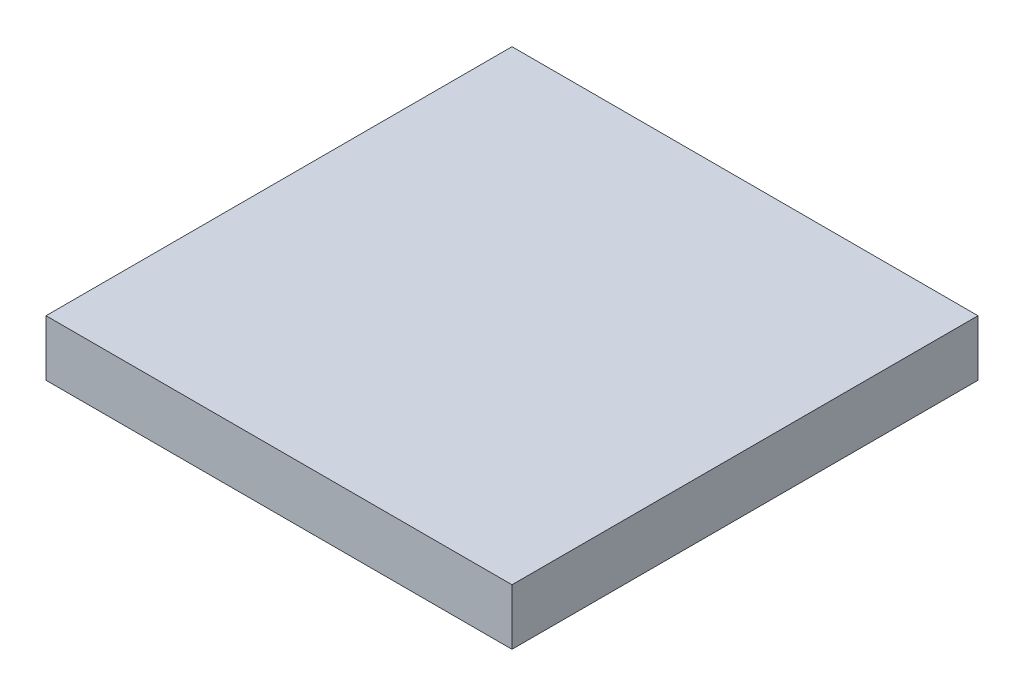
ISO-10303-21;
HEADER;
FILE_DESCRIPTION(('STEP AP214'),'2;1');
FILE_NAME('part.step','',(''),(''),'','','');
FILE_SCHEMA(('AUTOMOTIVE_DESIGN { 1 0 10303 214 1 1 1 1 }'));
ENDSEC;
DATA;
#1=APPLICATION_CONTEXT('core data for automotive mechanical design processes');
#2=APPLICATION_PROTOCOL_DEFINITION('international standard','automotive_design',2000,#1);
#3=PRODUCT_CONTEXT('',#1,'mechanical');
#4=PRODUCT('Part','Part','',(#3));
#5=PRODUCT_RELATED_PRODUCT_CATEGORY('part','',(#4));
#6=PRODUCT_DEFINITION_FORMATION('','',#4);
#7=PRODUCT_DEFINITION_CONTEXT('part definition',#1,'design');
#8=PRODUCT_DEFINITION('design','',#6,#7);
#9=PRODUCT_DEFINITION_SHAPE('','',#8);
#10=(LENGTH_UNIT() NAMED_UNIT(*) SI_UNIT(.MILLI.,.METRE.));
#11=(NAMED_UNIT(*) PLANE_ANGLE_UNIT() SI_UNIT($,.RADIAN.));
#12=(NAMED_UNIT(*) SI_UNIT($,.STERADIAN.) SOLID_ANGLE_UNIT());
#13=UNCERTAINTY_MEASURE_WITH_UNIT(LENGTH_MEASURE(1.E-05),#10,'distance_accuracy_value','');
#14=(GEOMETRIC_REPRESENTATION_CONTEXT(3) GLOBAL_UNCERTAINTY_ASSIGNED_CONTEXT((#13)) GLOBAL_UNIT_ASSIGNED_CONTEXT((#10,
#11,#12)) REPRESENTATION_CONTEXT('',''));
#15=CARTESIAN_POINT('',(0.,0.,0.));
#16=DIRECTION('',(0.,0.,1.));
#17=DIRECTION('',(1.,0.,0.));
#18=AXIS2_PLACEMENT_3D('',#15,#16,#17);
#19=CARTESIAN_POINT('',(12.5,3.,12.5));
#20=DIRECTION('',(-1.,0.,0.));
#21=DIRECTION('',(0.,0.,1.));
#22=AXIS2_PLACEMENT_3D('',#19,#20,#21);
#23=PLANE('',#22);
#24=DIRECTION('',(0.,0.,-1.));
#25=VECTOR('',#24,1.);
#26=CARTESIAN_POINT('',(12.5,0.,12.5));
#27=LINE('',#26,#25);
#28=CARTESIAN_POINT('',(12.5,0.,12.5));
#29=VERTEX_POINT('',#28);
#30=CARTESIAN_POINT('',(12.5,0.,-12.5));
#31=VERTEX_POINT('',#30);
#32=EDGE_CURVE('E96',#29,#31,#27,.T.);
#33=ORIENTED_EDGE('',*,*,#32,.T.);
#34=DIRECTION('',(0.,-1.,0.));
#35=VECTOR('',#34,1.);
#36=CARTESIAN_POINT('',(12.5,3.,-12.5));
#37=LINE('',#36,#35);
#38=CARTESIAN_POINT('',(12.5,3.,-12.5));
#39=VERTEX_POINT('',#38);
#40=EDGE_CURVE('E11',#39,#31,#37,.T.);
#41=ORIENTED_EDGE('',*,*,#40,.F.);
#42=DIRECTION('',(0.,0.,-1.));
#43=VECTOR('',#42,1.);
#44=CARTESIAN_POINT('',(12.5,3.,12.5));
#45=LINE('',#44,#43);
#46=CARTESIAN_POINT('',(12.5,3.,12.5));
#47=VERTEX_POINT('',#46);
#48=EDGE_CURVE('E84',#47,#39,#45,.T.);
#49=ORIENTED_EDGE('',*,*,#48,.F.);
#50=DIRECTION('',(0.,-1.,0.));
#51=VECTOR('',#50,1.);
#52=CARTESIAN_POINT('',(12.5,3.,12.5));
#53=LINE('',#52,#51);
#54=EDGE_CURVE('E92',#47,#29,#53,.T.);
#55=ORIENTED_EDGE('',*,*,#54,.T.);
#56=EDGE_LOOP('',(#33,#41,#49,#55));
#57=FACE_BOUND('',#56,.T.);
#58=ADVANCED_FACE('F33',(#57),#23,.F.);
#59=CARTESIAN_POINT('',(-12.5,3.,-12.5));
#60=DIRECTION('',(0.,0.,1.));
#61=DIRECTION('',(1.,0.,0.));
#62=AXIS2_PLACEMENT_3D('',#59,#60,#61);
#63=PLANE('',#62);
#64=DIRECTION('',(-1.,0.,0.));
#65=VECTOR('',#64,1.);
#66=CARTESIAN_POINT('',(-12.5,0.,-12.5));
#67=LINE('',#66,#65);
#68=CARTESIAN_POINT('',(-12.5,0.,-12.5));
#69=VERTEX_POINT('',#68);
#70=EDGE_CURVE('E88',#31,#69,#67,.T.);
#71=ORIENTED_EDGE('',*,*,#70,.T.);
#72=DIRECTION('',(0.,-1.,0.));
#73=VECTOR('',#72,1.);
#74=CARTESIAN_POINT('',(-12.5,3.,-12.5));
#75=LINE('',#74,#73);
#76=CARTESIAN_POINT('',(-12.5,3.,-12.5));
#77=VERTEX_POINT('',#76);
#78=EDGE_CURVE('E41',#77,#69,#75,.T.);
#79=ORIENTED_EDGE('',*,*,#78,.F.);
#80=DIRECTION('',(-1.,0.,0.));
#81=VECTOR('',#80,1.);
#82=CARTESIAN_POINT('',(-12.5,3.,-12.5));
#83=LINE('',#82,#81);
#84=EDGE_CURVE('E79',#39,#77,#83,.T.);
#85=ORIENTED_EDGE('',*,*,#84,.F.);
#86=ORIENTED_EDGE('',*,*,#40,.T.);
#87=EDGE_LOOP('',(#71,#79,#85,#86));
#88=FACE_BOUND('',#87,.T.);
#89=ADVANCED_FACE('F87',(#88),#63,.F.);
#90=CARTESIAN_POINT('',(-12.5,3.,12.5));
#91=DIRECTION('',(1.,0.,0.));
#92=DIRECTION('',(0.,0.,-1.));
#93=AXIS2_PLACEMENT_3D('',#90,#91,#92);
#94=PLANE('',#93);
#95=DIRECTION('',(0.,0.,1.));
#96=VECTOR('',#95,1.);
#97=CARTESIAN_POINT('',(-12.5,0.,12.5));
#98=LINE('',#97,#96);
#99=CARTESIAN_POINT('',(-12.5,0.,12.5));
#100=VERTEX_POINT('',#99);
#101=EDGE_CURVE('E66',#69,#100,#98,.T.);
#102=ORIENTED_EDGE('',*,*,#101,.T.);
#103=DIRECTION('',(0.,-1.,0.));
#104=VECTOR('',#103,1.);
#105=CARTESIAN_POINT('',(-12.5,3.,12.5));
#106=LINE('',#105,#104);
#107=CARTESIAN_POINT('',(-12.5,3.,12.5));
#108=VERTEX_POINT('',#107);
#109=EDGE_CURVE('E89',#108,#100,#106,.T.);
#110=ORIENTED_EDGE('',*,*,#109,.F.);
#111=DIRECTION('',(0.,0.,1.));
#112=VECTOR('',#111,1.);
#113=CARTESIAN_POINT('',(-12.5,3.,12.5));
#114=LINE('',#113,#112);
#115=EDGE_CURVE('E82',#77,#108,#114,.T.);
#116=ORIENTED_EDGE('',*,*,#115,.F.);
#117=ORIENTED_EDGE('',*,*,#78,.T.);
#118=EDGE_LOOP('',(#102,#110,#116,#117));
#119=FACE_BOUND('',#118,.T.);
#120=ADVANCED_FACE('F90',(#119),#94,.F.);
#121=CARTESIAN_POINT('',(-12.5,3.,12.5));
#122=DIRECTION('',(0.,0.,-1.));
#123=DIRECTION('',(-1.,0.,0.));
#124=AXIS2_PLACEMENT_3D('',#121,#122,#123);
#125=PLANE('',#124);
#126=DIRECTION('',(1.,0.,0.));
#127=VECTOR('',#126,1.);
#128=CARTESIAN_POINT('',(-12.5,0.,12.5));
#129=LINE('',#128,#127);
#130=EDGE_CURVE('E72',#100,#29,#129,.T.);
#131=ORIENTED_EDGE('',*,*,#130,.T.);
#132=ORIENTED_EDGE('',*,*,#54,.F.);
#133=DIRECTION('',(1.,0.,0.));
#134=VECTOR('',#133,1.);
#135=CARTESIAN_POINT('',(-12.5,3.,12.5));
#136=LINE('',#135,#134);
#137=EDGE_CURVE('E49',#108,#47,#136,.T.);
#138=ORIENTED_EDGE('',*,*,#137,.F.);
#139=ORIENTED_EDGE('',*,*,#109,.T.);
#140=EDGE_LOOP('',(#131,#132,#138,#139));
#141=FACE_BOUND('',#140,.T.);
#142=ADVANCED_FACE('F104',(#141),#125,.F.);
#143=CARTESIAN_POINT('',(0.,3.,0.));
#144=DIRECTION('',(0.,-1.,0.));
#145=DIRECTION('',(0.,0.,-1.));
#146=AXIS2_PLACEMENT_3D('',#143,#144,#145);
#147=PLANE('',#146);
#148=ORIENTED_EDGE('',*,*,#48,.T.);
#149=ORIENTED_EDGE('',*,*,#84,.T.);
#150=ORIENTED_EDGE('',*,*,#115,.T.);
#151=ORIENTED_EDGE('',*,*,#137,.T.);
#152=EDGE_LOOP('',(#148,#149,#150,#151));
#153=FACE_BOUND('',#152,.T.);
#154=ADVANCED_FACE('F80',(#153),#147,.F.);
#155=CARTESIAN_POINT('',(0.,0.,0.));
#156=DIRECTION('',(0.,-1.,0.));
#157=DIRECTION('',(0.,0.,-1.));
#158=AXIS2_PLACEMENT_3D('',#155,#156,#157);
#159=PLANE('',#158);
#160=CARTESIAN_POINT('',(-10.5,0.,-10.5));
#161=DIRECTION('',(0.,-1.,0.));
#162=DIRECTION('',(0.,0.,-1.));
#163=AXIS2_PLACEMENT_3D('',#160,#161,#162);
#164=CIRCLE('',#163,1.25);
#165=CARTESIAN_POINT('',(-10.5,0.,-11.75));
#166=VERTEX_POINT('',#165);
#167=EDGE_CURVE('E128',#166,#166,#164,.T.);
#168=ORIENTED_EDGE('',*,*,#167,.F.);
#169=EDGE_LOOP('',(#168));
#170=FACE_BOUND('',#169,.T.);
#171=CARTESIAN_POINT('',(10.5,0.,-10.5));
#172=DIRECTION('',(0.,-1.,0.));
#173=DIRECTION('',(0.,0.,-1.));
#174=AXIS2_PLACEMENT_3D('',#171,#172,#173);
#175=CIRCLE('',#174,1.25);
#176=CARTESIAN_POINT('',(10.5,0.,-11.75));
#177=VERTEX_POINT('',#176);
#178=EDGE_CURVE('E134',#177,#177,#175,.T.);
#179=ORIENTED_EDGE('',*,*,#178,.F.);
#180=EDGE_LOOP('',(#179));
#181=FACE_BOUND('',#180,.T.);
#182=CARTESIAN_POINT('',(10.5,0.,10.5));
#183=DIRECTION('',(0.,-1.,0.));
#184=DIRECTION('',(0.,0.,-1.));
#185=AXIS2_PLACEMENT_3D('',#182,#183,#184);
#186=CIRCLE('',#185,1.25);
#187=CARTESIAN_POINT('',(10.5,0.,9.25));
#188=VERTEX_POINT('',#187);
#189=EDGE_CURVE('E140',#188,#188,#186,.T.);
#190=ORIENTED_EDGE('',*,*,#189,.F.);
#191=EDGE_LOOP('',(#190));
#192=FACE_BOUND('',#191,.T.);
#193=CARTESIAN_POINT('',(-10.5,0.,10.5));
#194=DIRECTION('',(0.,-1.,0.));
#195=DIRECTION('',(0.,0.,-1.));
#196=AXIS2_PLACEMENT_3D('',#193,#194,#195);
#197=CIRCLE('',#196,1.25);
#198=CARTESIAN_POINT('',(-10.5,0.,9.25));
#199=VERTEX_POINT('',#198);
#200=EDGE_CURVE('E122',#199,#199,#197,.T.);
#201=ORIENTED_EDGE('',*,*,#200,.F.);
#202=EDGE_LOOP('',(#201));
#203=FACE_BOUND('',#202,.T.);
#204=CARTESIAN_POINT('',(0.,0.,0.));
#205=DIRECTION('',(0.,-1.,0.));
#206=DIRECTION('',(0.,0.,-1.));
#207=AXIS2_PLACEMENT_3D('',#204,#205,#206);
#208=CIRCLE('',#207,10.);
#209=CARTESIAN_POINT('',(0.,0.,-10.));
#210=VERTEX_POINT('',#209);
#211=EDGE_CURVE('E110',#210,#210,#208,.T.);
#212=ORIENTED_EDGE('',*,*,#211,.F.);
#213=EDGE_LOOP('',(#212));
#214=FACE_BOUND('',#213,.T.);
#215=ORIENTED_EDGE('',*,*,#32,.F.);
#216=ORIENTED_EDGE('',*,*,#130,.F.);
#217=ORIENTED_EDGE('',*,*,#101,.F.);
#218=ORIENTED_EDGE('',*,*,#70,.F.);
#219=EDGE_LOOP('',(#215,#216,#217,#218));
#220=FACE_BOUND('',#219,.T.);
#221=ADVANCED_FACE('F107',(#170,#181,#192,#203,#214,#220),#159,.T.);
#222=CARTESIAN_POINT('',(0.,2.,0.));
#223=DIRECTION('',(0.,-1.,0.));
#224=DIRECTION('',(0.,0.,-1.));
#225=AXIS2_PLACEMENT_3D('',#222,#223,#224);
#226=CYLINDRICAL_SURFACE('',#225,10.);
#227=CARTESIAN_POINT('',(0.,2.,0.));
#228=DIRECTION('',(0.,-1.,0.));
#229=DIRECTION('',(0.,0.,-1.));
#230=AXIS2_PLACEMENT_3D('',#227,#228,#229);
#231=CIRCLE('',#230,10.);
#232=CARTESIAN_POINT('',(0.,2.,-10.));
#233=VERTEX_POINT('',#232);
#234=EDGE_CURVE('E99',#233,#233,#231,.T.);
#235=ORIENTED_EDGE('',*,*,#234,.F.);
#236=EDGE_LOOP('',(#235));
#237=FACE_BOUND('',#236,.T.);
#238=ORIENTED_EDGE('',*,*,#211,.T.);
#239=EDGE_LOOP('',(#238));
#240=FACE_BOUND('',#239,.T.);
#241=ADVANCED_FACE('F157',(#237,#240),#226,.F.);
#242=CARTESIAN_POINT('',(0.,2.,0.));
#243=DIRECTION('',(0.,-1.,0.));
#244=DIRECTION('',(0.,0.,-1.));
#245=AXIS2_PLACEMENT_3D('',#242,#243,#244);
#246=PLANE('',#245);
#247=CARTESIAN_POINT('',(0.,2.,0.));
#248=DIRECTION('',(0.,-1.,0.));
#249=DIRECTION('',(0.,0.,-1.));
#250=AXIS2_PLACEMENT_3D('',#247,#248,#249);
#251=CIRCLE('',#250,5.);
#252=CARTESIAN_POINT('',(0.,2.,-5.));
#253=VERTEX_POINT('',#252);
#254=EDGE_CURVE('E113',#253,#253,#251,.T.);
#255=ORIENTED_EDGE('',*,*,#254,.F.);
#256=EDGE_LOOP('',(#255));
#257=FACE_BOUND('',#256,.T.);
#258=ORIENTED_EDGE('',*,*,#234,.T.);
#259=EDGE_LOOP('',(#258));
#260=FACE_BOUND('',#259,.T.);
#261=ADVANCED_FACE('F166',(#257,#260),#246,.T.);
#262=CARTESIAN_POINT('',(0.,2.,0.));
#263=DIRECTION('',(0.,-1.,0.));
#264=DIRECTION('',(0.,0.,-1.));
#265=AXIS2_PLACEMENT_3D('',#262,#263,#264);
#266=CYLINDRICAL_SURFACE('',#265,5.);
#267=ORIENTED_EDGE('',*,*,#254,.T.);
#268=EDGE_LOOP('',(#267));
#269=FACE_BOUND('',#268,.T.);
#270=CARTESIAN_POINT('',(0.,0.,0.));
#271=DIRECTION('',(0.,-1.,0.));
#272=DIRECTION('',(0.,0.,-1.));
#273=AXIS2_PLACEMENT_3D('',#270,#271,#272);
#274=CIRCLE('',#273,5.);
#275=CARTESIAN_POINT('',(0.,0.,-5.));
#276=VERTEX_POINT('',#275);
#277=EDGE_CURVE('E116',#276,#276,#274,.T.);
#278=ORIENTED_EDGE('',*,*,#277,.F.);
#279=EDGE_LOOP('',(#278));
#280=FACE_BOUND('',#279,.T.);
#281=ADVANCED_FACE('F172',(#269,#280),#266,.T.);
#282=ORIENTED_EDGE('',*,*,#277,.T.);
#283=EDGE_LOOP('',(#282));
#284=FACE_BOUND('',#283,.T.);
#285=ADVANCED_FACE('F160',(#284),#159,.T.);
#286=CARTESIAN_POINT('',(-10.5,2.,10.5));
#287=DIRECTION('',(0.,-1.,0.));
#288=DIRECTION('',(0.,0.,-1.));
#289=AXIS2_PLACEMENT_3D('',#286,#287,#288);
#290=CYLINDRICAL_SURFACE('',#289,1.25);
#291=CARTESIAN_POINT('',(-10.5,2.,10.5));
#292=DIRECTION('',(0.,-1.,0.));
#293=DIRECTION('',(0.,0.,-1.));
#294=AXIS2_PLACEMENT_3D('',#291,#292,#293);
#295=CIRCLE('',#294,1.25);
#296=CARTESIAN_POINT('',(-10.5,2.,9.25));
#297=VERTEX_POINT('',#296);
#298=EDGE_CURVE('E119',#297,#297,#295,.T.);
#299=ORIENTED_EDGE('',*,*,#298,.F.);
#300=EDGE_LOOP('',(#299));
#301=FACE_BOUND('',#300,.T.);
#302=ORIENTED_EDGE('',*,*,#200,.T.);
#303=EDGE_LOOP('',(#302));
#304=FACE_BOUND('',#303,.T.);
#305=ADVANCED_FACE('F206',(#301,#304),#290,.F.);
#306=CARTESIAN_POINT('',(-10.5,2.,10.5));
#307=DIRECTION('',(0.,-1.,0.));
#308=DIRECTION('',(0.,0.,-1.));
#309=AXIS2_PLACEMENT_3D('',#306,#307,#308);
#310=PLANE('',#309);
#311=ORIENTED_EDGE('',*,*,#298,.T.);
#312=EDGE_LOOP('',(#311));
#313=FACE_BOUND('',#312,.T.);
#314=ADVANCED_FACE('F151',(#313),#310,.T.);
#315=CARTESIAN_POINT('',(10.5,2.,10.5));
#316=DIRECTION('',(0.,-1.,0.));
#317=DIRECTION('',(0.,0.,-1.));
#318=AXIS2_PLACEMENT_3D('',#315,#316,#317);
#319=CYLINDRICAL_SURFACE('',#318,1.25);
#320=CARTESIAN_POINT('',(10.5,2.,10.5));
#321=DIRECTION('',(0.,-1.,0.));
#322=DIRECTION('',(0.,0.,-1.));
#323=AXIS2_PLACEMENT_3D('',#320,#321,#322);
#324=CIRCLE('',#323,1.25);
#325=CARTESIAN_POINT('',(10.5,2.,9.25));
#326=VERTEX_POINT('',#325);
#327=EDGE_CURVE('E125',#326,#326,#324,.T.);
#328=ORIENTED_EDGE('',*,*,#327,.F.);
#329=EDGE_LOOP('',(#328));
#330=FACE_BOUND('',#329,.T.);
#331=ORIENTED_EDGE('',*,*,#189,.T.);
#332=EDGE_LOOP('',(#331));
#333=FACE_BOUND('',#332,.T.);
#334=ADVANCED_FACE('F148',(#330,#333),#319,.F.);
#335=CARTESIAN_POINT('',(10.5,2.,10.5));
#336=DIRECTION('',(0.,-1.,0.));
#337=DIRECTION('',(0.,0.,-1.));
#338=AXIS2_PLACEMENT_3D('',#335,#336,#337);
#339=PLANE('',#338);
#340=ORIENTED_EDGE('',*,*,#327,.T.);
#341=EDGE_LOOP('',(#340));
#342=FACE_BOUND('',#341,.T.);
#343=ADVANCED_FACE('F146',(#342),#339,.T.);
#344=CARTESIAN_POINT('',(10.5,2.,-10.5));
#345=DIRECTION('',(0.,-1.,0.));
#346=DIRECTION('',(0.,0.,-1.));
#347=AXIS2_PLACEMENT_3D('',#344,#345,#346);
#348=CYLINDRICAL_SURFACE('',#347,1.25);
#349=CARTESIAN_POINT('',(10.5,2.,-10.5));
#350=DIRECTION('',(0.,-1.,0.));
#351=DIRECTION('',(0.,0.,-1.));
#352=AXIS2_PLACEMENT_3D('',#349,#350,#351);
#353=CIRCLE('',#352,1.25);
#354=CARTESIAN_POINT('',(10.5,2.,-11.75));
#355=VERTEX_POINT('',#354);
#356=EDGE_CURVE('E137',#355,#355,#353,.T.);
#357=ORIENTED_EDGE('',*,*,#356,.F.);
#358=EDGE_LOOP('',(#357));
#359=FACE_BOUND('',#358,.T.);
#360=ORIENTED_EDGE('',*,*,#178,.T.);
#361=EDGE_LOOP('',(#360));
#362=FACE_BOUND('',#361,.T.);
#363=ADVANCED_FACE('F236',(#359,#362),#348,.F.);
#364=CARTESIAN_POINT('',(10.5,2.,-10.5));
#365=DIRECTION('',(0.,-1.,0.));
#366=DIRECTION('',(0.,0.,-1.));
#367=AXIS2_PLACEMENT_3D('',#364,#365,#366);
#368=PLANE('',#367);
#369=ORIENTED_EDGE('',*,*,#356,.T.);
#370=EDGE_LOOP('',(#369));
#371=FACE_BOUND('',#370,.T.);
#372=ADVANCED_FACE('F245',(#371),#368,.T.);
#373=CARTESIAN_POINT('',(-10.5,2.,-10.5));
#374=DIRECTION('',(0.,-1.,0.));
#375=DIRECTION('',(0.,0.,-1.));
#376=AXIS2_PLACEMENT_3D('',#373,#374,#375);
#377=CYLINDRICAL_SURFACE('',#376,1.25);
#378=CARTESIAN_POINT('',(-10.5,2.,-10.5));
#379=DIRECTION('',(0.,-1.,0.));
#380=DIRECTION('',(0.,0.,-1.));
#381=AXIS2_PLACEMENT_3D('',#378,#379,#380);
#382=CIRCLE('',#381,1.25);
#383=CARTESIAN_POINT('',(-10.5,2.,-11.75));
#384=VERTEX_POINT('',#383);
#385=EDGE_CURVE('E131',#384,#384,#382,.T.);
#386=ORIENTED_EDGE('',*,*,#385,.F.);
#387=EDGE_LOOP('',(#386));
#388=FACE_BOUND('',#387,.T.);
#389=ORIENTED_EDGE('',*,*,#167,.T.);
#390=EDGE_LOOP('',(#389));
#391=FACE_BOUND('',#390,.T.);
#392=ADVANCED_FACE('F255',(#388,#391),#377,.F.);
#393=CARTESIAN_POINT('',(-10.5,2.,-10.5));
#394=DIRECTION('',(0.,-1.,0.));
#395=DIRECTION('',(0.,0.,-1.));
#396=AXIS2_PLACEMENT_3D('',#393,#394,#395);
#397=PLANE('',#396);
#398=ORIENTED_EDGE('',*,*,#385,.T.);
#399=EDGE_LOOP('',(#398));
#400=FACE_BOUND('',#399,.T.);
#401=ADVANCED_FACE('F265',(#400),#397,.T.);
#402=CLOSED_SHELL('',(#58,#89,#120,#142,#154,#221,#241,#261,#281,#285,#305,#314,#334,#343,#363,
#372,#392,#401));
#403=MANIFOLD_SOLID_BREP('B2',#402);
#404=ADVANCED_BREP_SHAPE_REPRESENTATION('',(#18,#403),#14);
#405=SHAPE_DEFINITION_REPRESENTATION(#9,#404);
ENDSEC;
END-ISO-10303-21;
